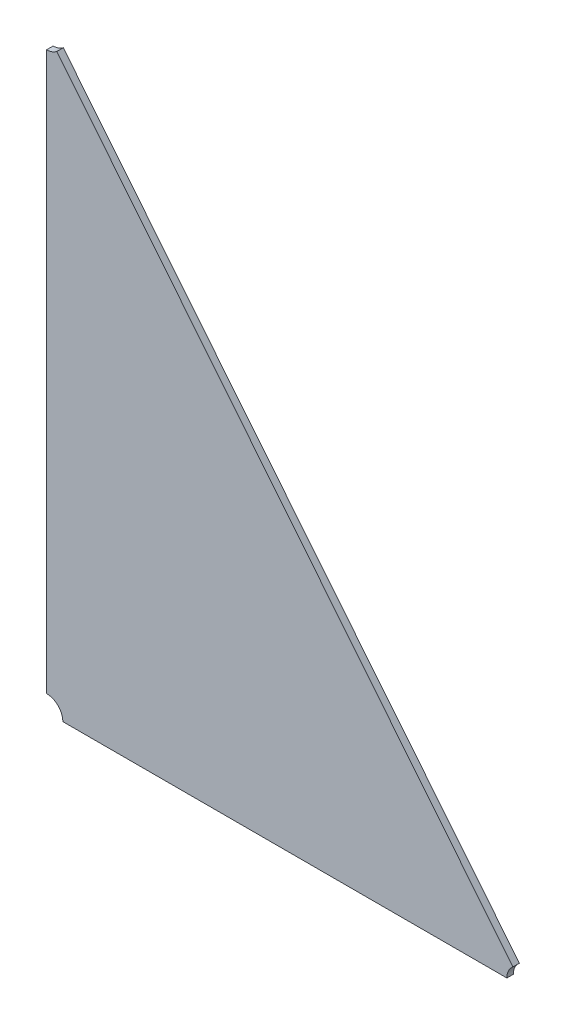
ISO-10303-21;
HEADER;
FILE_DESCRIPTION(('STEP AP214'),'2;1');
FILE_NAME('part.step','',(''),(''),'','','');
FILE_SCHEMA(('AUTOMOTIVE_DESIGN { 1 0 10303 214 1 1 1 1 }'));
ENDSEC;
DATA;
#1=APPLICATION_CONTEXT('core data for automotive mechanical design processes');
#2=APPLICATION_PROTOCOL_DEFINITION('international standard','automotive_design',2000,#1);
#3=PRODUCT_CONTEXT('',#1,'mechanical');
#4=PRODUCT('Part','Part','',(#3));
#5=PRODUCT_RELATED_PRODUCT_CATEGORY('part','',(#4));
#6=PRODUCT_DEFINITION_FORMATION('','',#4);
#7=PRODUCT_DEFINITION_CONTEXT('part definition',#1,'design');
#8=PRODUCT_DEFINITION('design','',#6,#7);
#9=PRODUCT_DEFINITION_SHAPE('','',#8);
#10=(LENGTH_UNIT() NAMED_UNIT(*) SI_UNIT(.MILLI.,.METRE.));
#11=(NAMED_UNIT(*) PLANE_ANGLE_UNIT() SI_UNIT($,.RADIAN.));
#12=(NAMED_UNIT(*) SI_UNIT($,.STERADIAN.) SOLID_ANGLE_UNIT());
#13=UNCERTAINTY_MEASURE_WITH_UNIT(LENGTH_MEASURE(1.E-05),#10,'distance_accuracy_value','');
#14=(GEOMETRIC_REPRESENTATION_CONTEXT(3) GLOBAL_UNCERTAINTY_ASSIGNED_CONTEXT((#13)) GLOBAL_UNIT_ASSIGNED_CONTEXT((#10,
#11,#12)) REPRESENTATION_CONTEXT('',''));
#15=CARTESIAN_POINT('',(0.,0.,0.));
#16=DIRECTION('',(0.,0.,1.));
#17=DIRECTION('',(1.,0.,0.));
#18=AXIS2_PLACEMENT_3D('',#15,#16,#17);
#19=CARTESIAN_POINT('',(-1.32656031399451,-1.15925301497806,0.002));
#20=DIRECTION('',(0.,0.,1.));
#21=DIRECTION('',(1.,0.,0.));
#22=AXIS2_PLACEMENT_3D('',#19,#20,#21);
#23=PLANE('',#22);
#24=CARTESIAN_POINT('',(-1.37630287528467,-1.2265091946304,0.002));
#25=DIRECTION('',(0.,0.,-1.));
#26=DIRECTION('',(0.,1.,0.));
#27=AXIS2_PLACEMENT_3D('',#24,#25,#26);
#28=CIRCLE('',#27,0.005);
#29=CARTESIAN_POINT('',(-1.37630287528467,-1.2215091946304,0.002));
#30=VERTEX_POINT('',#29);
#31=CARTESIAN_POINT('',(-1.37130287528467,-1.2265091946304,0.002));
#32=VERTEX_POINT('',#31);
#33=EDGE_CURVE('E11',#30,#32,#28,.T.);
#34=ORIENTED_EDGE('',*,*,#33,.T.);
#35=DIRECTION('',(1.,0.,0.));
#36=VECTOR('',#35,1.);
#37=CARTESIAN_POINT('',(-1.37130287528467,-1.2265091946304,0.002));
#38=LINE('',#37,#36);
#39=CARTESIAN_POINT('',(-1.2342847826118,-1.2265091946304,0.002));
#40=VERTEX_POINT('',#39);
#41=EDGE_CURVE('E83',#32,#40,#38,.T.);
#42=ORIENTED_EDGE('',*,*,#41,.T.);
#43=CARTESIAN_POINT('',(-1.2292847826118,-1.2265091946304,0.002));
#44=DIRECTION('',(0.,0.,-1.));
#45=DIRECTION('',(-1.,0.,0.));
#46=AXIS2_PLACEMENT_3D('',#43,#44,#45);
#47=CIRCLE('',#46,0.00499999999999999);
#48=CARTESIAN_POINT('',(-1.23242622865405,-1.22261929530476,0.002));
#49=VERTEX_POINT('',#48);
#50=EDGE_CURVE('E107',#40,#49,#47,.T.);
#51=ORIENTED_EDGE('',*,*,#50,.T.);
#52=DIRECTION('',(-0.628289208450209,0.777979865128276,0.));
#53=VECTOR('',#52,1.);
#54=CARTESIAN_POINT('',(-1.23242622865405,-1.22261929530476,0.002));
#55=LINE('',#54,#53);
#56=CARTESIAN_POINT('',(-1.37316142924241,-1.0483537645588,0.002));
#57=VERTEX_POINT('',#56);
#58=EDGE_CURVE('E110',#49,#57,#55,.T.);
#59=ORIENTED_EDGE('',*,*,#58,.T.);
#60=CARTESIAN_POINT('',(-1.37630287528467,-1.04446386523316,0.002));
#61=DIRECTION('',(0.,0.,-1.));
#62=DIRECTION('',(0.628289208451414,-0.777979865127302,0.));
#63=AXIS2_PLACEMENT_3D('',#60,#61,#62);
#64=CIRCLE('',#63,0.00500000000000005);
#65=CARTESIAN_POINT('',(-1.37630287528467,-1.04946386523316,0.002));
#66=VERTEX_POINT('',#65);
#67=EDGE_CURVE('E74',#57,#66,#64,.T.);
#68=ORIENTED_EDGE('',*,*,#67,.T.);
#69=DIRECTION('',(0.,-1.,0.));
#70=VECTOR('',#69,1.);
#71=CARTESIAN_POINT('',(-1.37630287528467,-1.04946386523316,0.002));
#72=LINE('',#71,#70);
#73=EDGE_CURVE('E103',#66,#30,#72,.T.);
#74=ORIENTED_EDGE('',*,*,#73,.T.);
#75=EDGE_LOOP('',(#34,#42,#51,#59,#68,#74));
#76=FACE_BOUND('',#75,.T.);
#77=ADVANCED_FACE('F17',(#76),#23,.T.);
#78=CARTESIAN_POINT('',(-1.2292847826118,-1.2265091946304,0.));
#79=DIRECTION('',(0.777979865128275,0.628289208450209,0.));
#80=DIRECTION('',(-0.628289208450209,0.777979865128275,0.));
#81=AXIS2_PLACEMENT_3D('',#78,#79,#80);
#82=PLANE('',#81);
#83=DIRECTION('',(0.,0.,1.));
#84=VECTOR('',#83,1.);
#85=CARTESIAN_POINT('',(-1.37316142924241,-1.0483537645588,0.));
#86=LINE('',#85,#84);
#87=CARTESIAN_POINT('',(-1.37316142924241,-1.0483537645588,0.));
#88=VERTEX_POINT('',#87);
#89=EDGE_CURVE('E24',#88,#57,#86,.T.);
#90=ORIENTED_EDGE('',*,*,#89,.T.);
#91=ORIENTED_EDGE('',*,*,#58,.F.);
#92=DIRECTION('',(-1.11022302462516E-13,0.,-1.));
#93=VECTOR('',#92,1.);
#94=CARTESIAN_POINT('',(-1.23242622865405,-1.22261929530476,0.002));
#95=LINE('',#94,#93);
#96=CARTESIAN_POINT('',(-1.23242622865405,-1.22261929530476,0.));
#97=VERTEX_POINT('',#96);
#98=EDGE_CURVE('E68',#49,#97,#95,.T.);
#99=ORIENTED_EDGE('',*,*,#98,.T.);
#100=DIRECTION('',(-0.628289208450209,0.777979865128276,0.));
#101=VECTOR('',#100,1.);
#102=CARTESIAN_POINT('',(-1.23242622865405,-1.22261929530476,0.));
#103=LINE('',#102,#101);
#104=EDGE_CURVE('E65',#97,#88,#103,.T.);
#105=ORIENTED_EDGE('',*,*,#104,.T.);
#106=EDGE_LOOP('',(#90,#91,#99,#105));
#107=FACE_BOUND('',#106,.T.);
#108=ADVANCED_FACE('F66',(#107),#82,.T.);
#109=CARTESIAN_POINT('',(-1.37630287528467,-1.04446386523316,0.));
#110=DIRECTION('',(-1.,0.,0.));
#111=DIRECTION('',(0.,-1.,0.));
#112=AXIS2_PLACEMENT_3D('',#109,#110,#111);
#113=PLANE('',#112);
#114=DIRECTION('',(0.,0.,1.));
#115=VECTOR('',#114,1.);
#116=CARTESIAN_POINT('',(-1.37630287528467,-1.2215091946304,0.));
#117=LINE('',#116,#115);
#118=CARTESIAN_POINT('',(-1.37630287528467,-1.2215091946304,0.));
#119=VERTEX_POINT('',#118);
#120=EDGE_CURVE('E112',#119,#30,#117,.T.);
#121=ORIENTED_EDGE('',*,*,#120,.T.);
#122=ORIENTED_EDGE('',*,*,#73,.F.);
#123=DIRECTION('',(0.,-1.11022302462516E-13,-1.));
#124=VECTOR('',#123,1.);
#125=CARTESIAN_POINT('',(-1.37630287528467,-1.04946386523316,0.002));
#126=LINE('',#125,#124);
#127=CARTESIAN_POINT('',(-1.37630287528467,-1.04946386523316,0.));
#128=VERTEX_POINT('',#127);
#129=EDGE_CURVE('E73',#66,#128,#126,.T.);
#130=ORIENTED_EDGE('',*,*,#129,.T.);
#131=DIRECTION('',(0.,-1.,0.));
#132=VECTOR('',#131,1.);
#133=CARTESIAN_POINT('',(-1.37630287528467,-1.04946386523316,0.));
#134=LINE('',#133,#132);
#135=EDGE_CURVE('E87',#128,#119,#134,.T.);
#136=ORIENTED_EDGE('',*,*,#135,.T.);
#137=EDGE_LOOP('',(#121,#122,#130,#136));
#138=FACE_BOUND('',#137,.T.);
#139=ADVANCED_FACE('F126',(#138),#113,.T.);
#140=CARTESIAN_POINT('',(-1.37630287528467,-1.2265091946304,0.));
#141=DIRECTION('',(0.,-1.,0.));
#142=DIRECTION('',(1.,0.,0.));
#143=AXIS2_PLACEMENT_3D('',#140,#141,#142);
#144=PLANE('',#143);
#145=DIRECTION('',(0.,0.,-1.));
#146=VECTOR('',#145,1.);
#147=CARTESIAN_POINT('',(-1.37130287528467,-1.2265091946304,0.002));
#148=LINE('',#147,#146);
#149=CARTESIAN_POINT('',(-1.37130287528467,-1.2265091946304,0.));
#150=VERTEX_POINT('',#149);
#151=EDGE_CURVE('E105',#32,#150,#148,.T.);
#152=ORIENTED_EDGE('',*,*,#151,.T.);
#153=DIRECTION('',(1.,0.,0.));
#154=VECTOR('',#153,1.);
#155=CARTESIAN_POINT('',(-1.37130287528467,-1.2265091946304,0.));
#156=LINE('',#155,#154);
#157=CARTESIAN_POINT('',(-1.2342847826118,-1.2265091946304,0.));
#158=VERTEX_POINT('',#157);
#159=EDGE_CURVE('E98',#150,#158,#156,.T.);
#160=ORIENTED_EDGE('',*,*,#159,.T.);
#161=DIRECTION('',(0.,0.,1.));
#162=VECTOR('',#161,1.);
#163=CARTESIAN_POINT('',(-1.2342847826118,-1.2265091946304,0.));
#164=LINE('',#163,#162);
#165=EDGE_CURVE('E88',#158,#40,#164,.T.);
#166=ORIENTED_EDGE('',*,*,#165,.T.);
#167=ORIENTED_EDGE('',*,*,#41,.F.);
#168=EDGE_LOOP('',(#152,#160,#166,#167));
#169=FACE_BOUND('',#168,.T.);
#170=ADVANCED_FACE('F118',(#169),#144,.T.);
#171=CARTESIAN_POINT('',(-1.32656031399451,-1.15925301497806,0.));
#172=DIRECTION('',(0.,0.,1.));
#173=DIRECTION('',(1.,0.,0.));
#174=AXIS2_PLACEMENT_3D('',#171,#172,#173);
#175=PLANE('',#174);
#176=CARTESIAN_POINT('',(-1.37630287528467,-1.2265091946304,0.));
#177=DIRECTION('',(0.,0.,1.));
#178=DIRECTION('',(1.,0.,0.));
#179=AXIS2_PLACEMENT_3D('',#176,#177,#178);
#180=CIRCLE('',#179,0.005);
#181=EDGE_CURVE('E100',#150,#119,#180,.T.);
#182=ORIENTED_EDGE('',*,*,#181,.T.);
#183=ORIENTED_EDGE('',*,*,#135,.F.);
#184=CARTESIAN_POINT('',(-1.37630287528467,-1.04446386523316,0.));
#185=DIRECTION('',(0.,0.,1.));
#186=DIRECTION('',(0.,-1.,0.));
#187=AXIS2_PLACEMENT_3D('',#184,#185,#186);
#188=CIRCLE('',#187,0.00500000000000005);
#189=EDGE_CURVE('E81',#128,#88,#188,.T.);
#190=ORIENTED_EDGE('',*,*,#189,.T.);
#191=ORIENTED_EDGE('',*,*,#104,.F.);
#192=CARTESIAN_POINT('',(-1.2292847826118,-1.2265091946304,0.));
#193=DIRECTION('',(0.,0.,1.));
#194=DIRECTION('',(-0.628289208450206,0.777979865128278,0.));
#195=AXIS2_PLACEMENT_3D('',#192,#193,#194);
#196=CIRCLE('',#195,0.00499999999999999);
#197=EDGE_CURVE('E89',#97,#158,#196,.T.);
#198=ORIENTED_EDGE('',*,*,#197,.T.);
#199=ORIENTED_EDGE('',*,*,#159,.F.);
#200=EDGE_LOOP('',(#182,#183,#190,#191,#198,#199));
#201=FACE_BOUND('',#200,.T.);
#202=ADVANCED_FACE('F85',(#201),#175,.F.);
#203=CARTESIAN_POINT('',(-1.2292847826118,-1.2265091946304,0.002));
#204=DIRECTION('',(0.,0.,1.));
#205=DIRECTION('',(-1.,0.,0.));
#206=AXIS2_PLACEMENT_3D('',#203,#204,#205);
#207=CYLINDRICAL_SURFACE('',#206,0.00499999999999999);
#208=ORIENTED_EDGE('',*,*,#98,.F.);
#209=ORIENTED_EDGE('',*,*,#50,.F.);
#210=ORIENTED_EDGE('',*,*,#165,.F.);
#211=ORIENTED_EDGE('',*,*,#197,.F.);
#212=EDGE_LOOP('',(#208,#209,#210,#211));
#213=FACE_BOUND('',#212,.T.);
#214=ADVANCED_FACE('F121',(#213),#207,.F.);
#215=CARTESIAN_POINT('',(-1.37630287528467,-1.04446386523316,0.002));
#216=DIRECTION('',(0.,0.,1.));
#217=DIRECTION('',(-1.,0.,0.));
#218=AXIS2_PLACEMENT_3D('',#215,#216,#217);
#219=CYLINDRICAL_SURFACE('',#218,0.00500000000000005);
#220=ORIENTED_EDGE('',*,*,#89,.F.);
#221=ORIENTED_EDGE('',*,*,#189,.F.);
#222=ORIENTED_EDGE('',*,*,#129,.F.);
#223=ORIENTED_EDGE('',*,*,#67,.F.);
#224=EDGE_LOOP('',(#220,#221,#222,#223));
#225=FACE_BOUND('',#224,.T.);
#226=ADVANCED_FACE('F79',(#225),#219,.F.);
#227=CARTESIAN_POINT('',(-1.37630287528467,-1.2265091946304,0.002));
#228=DIRECTION('',(0.,0.,1.));
#229=DIRECTION('',(-1.,0.,0.));
#230=AXIS2_PLACEMENT_3D('',#227,#228,#229);
#231=CYLINDRICAL_SURFACE('',#230,0.005);
#232=ORIENTED_EDGE('',*,*,#120,.F.);
#233=ORIENTED_EDGE('',*,*,#181,.F.);
#234=ORIENTED_EDGE('',*,*,#151,.F.);
#235=ORIENTED_EDGE('',*,*,#33,.F.);
#236=EDGE_LOOP('',(#232,#233,#234,#235));
#237=FACE_BOUND('',#236,.T.);
#238=ADVANCED_FACE('F127',(#237),#231,.F.);
#239=CLOSED_SHELL('',(#77,#108,#139,#170,#202,#214,#226,#238));
#240=MANIFOLD_SOLID_BREP('B1',#239);
#241=ADVANCED_BREP_SHAPE_REPRESENTATION('',(#18,#240),#14);
#242=SHAPE_DEFINITION_REPRESENTATION(#9,#241);
ENDSEC;
END-ISO-10303-21;
